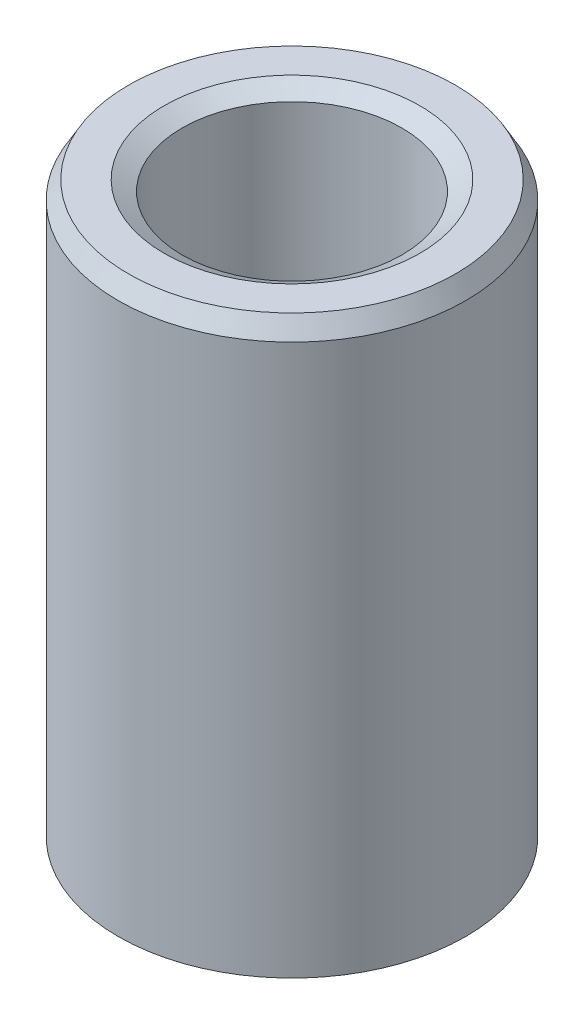
ISO-10303-21;
HEADER;
FILE_DESCRIPTION(('STEP AP214'),'2;1');
FILE_NAME('part.step','',(''),(''),'','','');
FILE_SCHEMA(('AUTOMOTIVE_DESIGN { 1 0 10303 214 1 1 1 1 }'));
ENDSEC;
DATA;
#1=APPLICATION_CONTEXT('core data for automotive mechanical design processes');
#2=APPLICATION_PROTOCOL_DEFINITION('international standard','automotive_design',2000,#1);
#3=PRODUCT_CONTEXT('',#1,'mechanical');
#4=PRODUCT('Part','Part','',(#3));
#5=PRODUCT_RELATED_PRODUCT_CATEGORY('part','',(#4));
#6=PRODUCT_DEFINITION_FORMATION('','',#4);
#7=PRODUCT_DEFINITION_CONTEXT('part definition',#1,'design');
#8=PRODUCT_DEFINITION('design','',#6,#7);
#9=PRODUCT_DEFINITION_SHAPE('','',#8);
#10=(LENGTH_UNIT() NAMED_UNIT(*) SI_UNIT(.MILLI.,.METRE.));
#11=(NAMED_UNIT(*) PLANE_ANGLE_UNIT() SI_UNIT($,.RADIAN.));
#12=(NAMED_UNIT(*) SI_UNIT($,.STERADIAN.) SOLID_ANGLE_UNIT());
#13=UNCERTAINTY_MEASURE_WITH_UNIT(LENGTH_MEASURE(1.E-05),#10,'distance_accuracy_value','');
#14=(GEOMETRIC_REPRESENTATION_CONTEXT(3) GLOBAL_UNCERTAINTY_ASSIGNED_CONTEXT((#13)) GLOBAL_UNIT_ASSIGNED_CONTEXT((#10,
#11,#12)) REPRESENTATION_CONTEXT('',''));
#15=CARTESIAN_POINT('',(0.,0.,0.));
#16=DIRECTION('',(0.,0.,1.));
#17=DIRECTION('',(1.,0.,0.));
#18=AXIS2_PLACEMENT_3D('',#15,#16,#17);
#19=CARTESIAN_POINT('',(0.,124.881797904271,0.));
#20=DIRECTION('',(0.,-1.,0.));
#21=DIRECTION('',(0.,0.,-1.));
#22=AXIS2_PLACEMENT_3D('',#19,#20,#21);
#23=CYLINDRICAL_SURFACE('',#22,37.5);
#24=CARTESIAN_POINT('',(0.,2.23251376503614,0.));
#25=DIRECTION('',(0.,1.,0.));
#26=DIRECTION('',(0.,0.,1.));
#27=AXIS2_PLACEMENT_3D('',#24,#25,#26);
#28=CIRCLE('',#27,37.5);
#29=CARTESIAN_POINT('',(0.,2.23251376503614,37.5));
#30=VERTEX_POINT('',#29);
#31=EDGE_CURVE('E10',#30,#30,#28,.T.);
#32=ORIENTED_EDGE('',*,*,#31,.T.);
#33=EDGE_LOOP('',(#32));
#34=FACE_BOUND('',#33,.T.);
#35=CARTESIAN_POINT('',(0.,121.014970634632,0.));
#36=DIRECTION('',(0.,1.,0.));
#37=DIRECTION('',(0.,0.,1.));
#38=AXIS2_PLACEMENT_3D('',#35,#36,#37);
#39=CIRCLE('',#38,37.5);
#40=CARTESIAN_POINT('',(0.,121.014970634632,-37.5));
#41=VERTEX_POINT('',#40);
#42=EDGE_CURVE('E50',#41,#41,#39,.F.);
#43=ORIENTED_EDGE('',*,*,#42,.T.);
#44=EDGE_LOOP('',(#43));
#45=FACE_BOUND('',#44,.T.);
#46=ADVANCED_FACE('F39',(#34,#45),#23,.T.);
#47=CARTESIAN_POINT('',(0.,124.881797904271,0.));
#48=DIRECTION('',(0.,1.,0.));
#49=DIRECTION('',(0.,0.,1.));
#50=AXIS2_PLACEMENT_3D('',#47,#48,#49);
#51=PLANE('',#50);
#52=CARTESIAN_POINT('',(0.,124.881797904271,0.));
#53=DIRECTION('',(0.,1.,0.));
#54=DIRECTION('',(0.,0.,1.));
#55=AXIS2_PLACEMENT_3D('',#52,#53,#54);
#56=CIRCLE('',#55,27.5829610137691);
#57=CARTESIAN_POINT('',(0.,124.881797904271,27.5829610137691));
#58=VERTEX_POINT('',#57);
#59=EDGE_CURVE('E58',#58,#58,#56,.F.);
#60=ORIENTED_EDGE('',*,*,#59,.T.);
#61=EDGE_LOOP('',(#60));
#62=FACE_BOUND('',#61,.T.);
#63=CARTESIAN_POINT('',(0.,124.881797904271,0.));
#64=DIRECTION('',(0.,1.,0.));
#65=DIRECTION('',(0.,0.,1.));
#66=AXIS2_PLACEMENT_3D('',#63,#64,#65);
#67=CIRCLE('',#66,35.2674862349639);
#68=CARTESIAN_POINT('',(0.,124.881797904271,-35.2674862349639));
#69=VERTEX_POINT('',#68);
#70=EDGE_CURVE('E61',#69,#69,#67,.T.);
#71=ORIENTED_EDGE('',*,*,#70,.T.);
#72=EDGE_LOOP('',(#71));
#73=FACE_BOUND('',#72,.T.);
#74=ADVANCED_FACE('F88',(#62,#73),#51,.T.);
#75=CARTESIAN_POINT('',(0.,0.,0.));
#76=DIRECTION('',(0.,1.,0.));
#77=DIRECTION('',(0.,0.,1.));
#78=AXIS2_PLACEMENT_3D('',#75,#76,#77);
#79=PLANE('',#78);
#80=CARTESIAN_POINT('',(0.,0.,0.));
#81=DIRECTION('',(0.,1.,0.));
#82=DIRECTION('',(0.,0.,1.));
#83=AXIS2_PLACEMENT_3D('',#80,#81,#82);
#84=CIRCLE('',#83,25.9486475091657);
#85=CARTESIAN_POINT('',(0.,0.,25.9486475091657));
#86=VERTEX_POINT('',#85);
#87=EDGE_CURVE('E51',#86,#86,#84,.T.);
#88=ORIENTED_EDGE('',*,*,#87,.T.);
#89=EDGE_LOOP('',(#88));
#90=FACE_BOUND('',#89,.T.);
#91=CARTESIAN_POINT('',(0.,0.,0.));
#92=DIRECTION('',(0.,1.,0.));
#93=DIRECTION('',(0.,0.,1.));
#94=AXIS2_PLACEMENT_3D('',#91,#92,#93);
#95=CIRCLE('',#94,33.6331727303605);
#96=CARTESIAN_POINT('',(0.,0.,33.6331727303605));
#97=VERTEX_POINT('',#96);
#98=EDGE_CURVE('E54',#97,#97,#95,.F.);
#99=ORIENTED_EDGE('',*,*,#98,.T.);
#100=EDGE_LOOP('',(#99));
#101=FACE_BOUND('',#100,.T.);
#102=ADVANCED_FACE('F83',(#90,#101),#79,.F.);
#103=CARTESIAN_POINT('',(0.,124.881797904271,0.));
#104=DIRECTION('',(0.,-1.,0.));
#105=DIRECTION('',(0.,0.,-1.));
#106=AXIS2_PLACEMENT_3D('',#103,#104,#105);
#107=CYLINDRICAL_SURFACE('',#106,23.7161337441296);
#108=CARTESIAN_POINT('',(0.,122.649284139235,0.));
#109=DIRECTION('',(0.,1.,0.));
#110=DIRECTION('',(0.,0.,1.));
#111=AXIS2_PLACEMENT_3D('',#108,#109,#110);
#112=CIRCLE('',#111,23.7161337441296);
#113=CARTESIAN_POINT('',(0.,122.649284139235,23.7161337441296));
#114=VERTEX_POINT('',#113);
#115=EDGE_CURVE('E67',#114,#114,#112,.T.);
#116=ORIENTED_EDGE('',*,*,#115,.T.);
#117=EDGE_LOOP('',(#116));
#118=FACE_BOUND('',#117,.T.);
#119=CARTESIAN_POINT('',(0.,3.86682726963951,0.));
#120=DIRECTION('',(0.,1.,0.));
#121=DIRECTION('',(0.,0.,1.));
#122=AXIS2_PLACEMENT_3D('',#119,#120,#121);
#123=CIRCLE('',#122,23.7161337441296);
#124=CARTESIAN_POINT('',(0.,3.86682726963951,23.7161337441296));
#125=VERTEX_POINT('',#124);
#126=EDGE_CURVE('E69',#125,#125,#123,.F.);
#127=ORIENTED_EDGE('',*,*,#126,.T.);
#128=EDGE_LOOP('',(#127));
#129=FACE_BOUND('',#128,.T.);
#130=ADVANCED_FACE('F71',(#118,#129),#107,.F.);
#131=CARTESIAN_POINT('',(0.,122.649284139235,0.));
#132=DIRECTION('',(0.,1.,0.));
#133=DIRECTION('',(0.,0.,1.));
#134=AXIS2_PLACEMENT_3D('',#131,#132,#133);
#135=CONICAL_SURFACE('',#134,23.7161337441296,1.0471975511966);
#136=ORIENTED_EDGE('',*,*,#59,.F.);
#137=EDGE_LOOP('',(#136));
#138=FACE_BOUND('',#137,.T.);
#139=ORIENTED_EDGE('',*,*,#115,.F.);
#140=EDGE_LOOP('',(#139));
#141=FACE_BOUND('',#140,.T.);
#142=ADVANCED_FACE('F77',(#138,#141),#135,.F.);
#143=CARTESIAN_POINT('',(0.,0.,0.));
#144=DIRECTION('',(0.,-1.,0.));
#145=DIRECTION('',(0.,0.,-1.));
#146=AXIS2_PLACEMENT_3D('',#143,#144,#145);
#147=CONICAL_SURFACE('',#146,25.9486475091657,0.523598775598293);
#148=ORIENTED_EDGE('',*,*,#126,.F.);
#149=EDGE_LOOP('',(#148));
#150=FACE_BOUND('',#149,.T.);
#151=ORIENTED_EDGE('',*,*,#87,.F.);
#152=EDGE_LOOP('',(#151));
#153=FACE_BOUND('',#152,.T.);
#154=ADVANCED_FACE('F73',(#150,#153),#147,.F.);
#155=CARTESIAN_POINT('',(0.,2.23251376503614,0.));
#156=DIRECTION('',(0.,1.,0.));
#157=DIRECTION('',(0.,0.,1.));
#158=AXIS2_PLACEMENT_3D('',#155,#156,#157);
#159=CONICAL_SURFACE('',#158,37.5,1.0471975511966);
#160=ORIENTED_EDGE('',*,*,#98,.F.);
#161=EDGE_LOOP('',(#160));
#162=FACE_BOUND('',#161,.T.);
#163=ORIENTED_EDGE('',*,*,#31,.F.);
#164=EDGE_LOOP('',(#163));
#165=FACE_BOUND('',#164,.T.);
#166=ADVANCED_FACE('F76',(#162,#165),#159,.T.);
#167=CARTESIAN_POINT('',(0.,124.881797904271,0.));
#168=DIRECTION('',(0.,-1.,0.));
#169=DIRECTION('',(0.,0.,-1.));
#170=AXIS2_PLACEMENT_3D('',#167,#168,#169);
#171=CONICAL_SURFACE('',#170,35.2674862349639,0.523598775598296);
#172=CARTESIAN_POINT('',(0.,121.014970634632,-37.5));
#173=CARTESIAN_POINT('',(0.,121.055250085357,-37.4767446482809));
#174=CARTESIAN_POINT('',(0.,121.095529536082,-37.4534892965618));
#175=CARTESIAN_POINT('',(0.,121.176088437533,-37.4069785931235));
#176=CARTESIAN_POINT('',(0.,121.216367888259,-37.3837232414044));
#177=CARTESIAN_POINT('',(0.,121.29692678971,-37.3372125379661));
#178=CARTESIAN_POINT('',(0.,121.337206240435,-37.313957186247));
#179=CARTESIAN_POINT('',(0.,121.417765141886,-37.2674464828087));
#180=CARTESIAN_POINT('',(0.,121.458044592611,-37.2441911310896));
#181=CARTESIAN_POINT('',(0.,121.538603494062,-37.1976804276514));
#182=CARTESIAN_POINT('',(0.,121.578882944787,-37.1744250759322));
#183=CARTESIAN_POINT('',(0.,121.659441846238,-37.127914372494));
#184=CARTESIAN_POINT('',(0.,121.699721296964,-37.1046590207749));
#185=CARTESIAN_POINT('',(0.,121.780280198414,-37.0581483173366));
#186=CARTESIAN_POINT('',(0.,121.82055964914,-37.0348929656175));
#187=CARTESIAN_POINT('',(0.,121.901118550591,-36.9883822621792));
#188=CARTESIAN_POINT('',(0.,121.941398001316,-36.9651269104601));
#189=CARTESIAN_POINT('',(0.,122.021956902767,-36.9186162070219));
#190=CARTESIAN_POINT('',(0.,122.062236353492,-36.8953608553027));
#191=CARTESIAN_POINT('',(0.,122.142795254943,-36.8488501518645));
#192=CARTESIAN_POINT('',(0.,122.183074705669,-36.8255948001453));
#193=CARTESIAN_POINT('',(0.,122.263633607119,-36.7790840967071));
#194=CARTESIAN_POINT('',(0.,122.303913057845,-36.755828744988));
#195=CARTESIAN_POINT('',(0.,122.384471959296,-36.7093180415497));
#196=CARTESIAN_POINT('',(0.,122.424751410021,-36.6860626898306));
#197=CARTESIAN_POINT('',(0.,122.505310311472,-36.6395519863923));
#198=CARTESIAN_POINT('',(0.,122.545589762197,-36.6162966346732));
#199=CARTESIAN_POINT('',(0.,122.626148663648,-36.569785931235));
#200=CARTESIAN_POINT('',(0.,122.666428114374,-36.5465305795158));
#201=CARTESIAN_POINT('',(0.,122.746987015824,-36.5000198760776));
#202=CARTESIAN_POINT('',(0.,122.78726646655,-36.4767645243585));
#203=CARTESIAN_POINT('',(0.,122.867825368001,-36.4302538209202));
#204=CARTESIAN_POINT('',(0.,122.908104818726,-36.4069984692011));
#205=CARTESIAN_POINT('',(0.,122.988663720177,-36.3604877657628));
#206=CARTESIAN_POINT('',(0.,123.028943170902,-36.3372324140437));
#207=CARTESIAN_POINT('',(0.,123.109502072353,-36.2907217106054));
#208=CARTESIAN_POINT('',(0.,123.149781523078,-36.2674663588863));
#209=CARTESIAN_POINT('',(0.,123.230340424529,-36.2209556554481));
#210=CARTESIAN_POINT('',(0.,123.270619875255,-36.1977003037289));
#211=CARTESIAN_POINT('',(0.,123.351178776705,-36.1511896002907));
#212=CARTESIAN_POINT('',(0.,123.391458227431,-36.1279342485716));
#213=CARTESIAN_POINT('',(0.,123.472017128882,-36.0814235451333));
#214=CARTESIAN_POINT('',(0.,123.512296579607,-36.0581681934142));
#215=CARTESIAN_POINT('',(0.,123.592855481058,-36.0116574899759));
#216=CARTESIAN_POINT('',(0.,123.633134931783,-35.9884021382568));
#217=CARTESIAN_POINT('',(0.,123.713693833234,-35.9418914348185));
#218=CARTESIAN_POINT('',(0.,123.75397328396,-35.9186360830994));
#219=CARTESIAN_POINT('',(0.,123.83453218541,-35.8721253796612));
#220=CARTESIAN_POINT('',(0.,123.874811636136,-35.848870027942));
#221=CARTESIAN_POINT('',(0.,123.955370537587,-35.8023593245038));
#222=CARTESIAN_POINT('',(0.,123.995649988312,-35.7791039727847));
#223=CARTESIAN_POINT('',(0.,124.076208889763,-35.7325932693464));
#224=CARTESIAN_POINT('',(0.,124.116488340488,-35.7093379176273));
#225=CARTESIAN_POINT('',(0.,124.197047241939,-35.662827214189));
#226=CARTESIAN_POINT('',(0.,124.237326692665,-35.6395718624699));
#227=CARTESIAN_POINT('',(0.,124.317885594115,-35.5930611590317));
#228=CARTESIAN_POINT('',(0.,124.358165044841,-35.5698058073125));
#229=CARTESIAN_POINT('',(0.,124.438723946292,-35.5232951038743));
#230=CARTESIAN_POINT('',(0.,124.479003397017,-35.5000397521551));
#231=CARTESIAN_POINT('',(0.,124.559562298468,-35.4535290487169));
#232=CARTESIAN_POINT('',(0.,124.599841749193,-35.4302736969978));
#233=CARTESIAN_POINT('',(0.,124.680400650644,-35.3837629935595));
#234=CARTESIAN_POINT('',(0.,124.720680101369,-35.3605076418404));
#235=CARTESIAN_POINT('',(0.,124.80123900282,-35.3139969384021));
#236=CARTESIAN_POINT('',(0.,124.841518453546,-35.290741586683));
#237=CARTESIAN_POINT('',(0.,124.881797904271,-35.2674862349639));
#238=B_SPLINE_CURVE_WITH_KNOTS('',3,(#172,#173,#174,#175,#176,#177,#178,#179,#180,#181,#182,
#183,#184,#185,#186,#187,#188,#189,#190,#191,#192,#193,#194,#195,#196,#197,#198,#199,#200,#201,
#202,#203,#204,#205,#206,#207,#208,#209,#210,#211,#212,#213,#214,#215,#216,#217,#218,#219,#220,
#221,#222,#223,#224,#225,#226,#227,#228,#229,#230,#231,#232,#233,#234,#235,#236,#237),
.UNSPECIFIED.,.F.,.F.,(4,2,2,2,2,2,2,2,2,2,2,2,2,2,2,2,2,2,2,2,2,2,2,2,2,2,2,2,2,2,2,2,4),(0.,
0.139532110314771,0.279064220629526,0.418596330944281,0.558128441259036,0.697660551573804,
0.837192661888559,0.976724772203317,1.11625688251807,1.25578899283283,1.39532110314759,
1.53485321346235,1.67438532377711,1.81391743409186,1.95344954440663,2.09298165472139,
2.23251376503614,2.3720458753509,2.51157798566565,2.65111009598042,2.79064220629518,
2.93017431660993,3.06970642692469,3.20923853723946,3.34877064755421,3.48830275786897,
3.62783486818372,3.76736697849848,3.90689908881325,4.046431199128,4.18596330944276,
4.32549541975751,4.46502753007228),.UNSPECIFIED.);
#239=EDGE_CURVE('BSEAM45',#41,#69,#238,.T.);
#240=ORIENTED_EDGE('',*,*,#42,.F.);
#241=ORIENTED_EDGE('',*,*,#70,.F.);
#242=ORIENTED_EDGE('',*,*,#239,.T.);
#243=ORIENTED_EDGE('',*,*,#239,.F.);
#244=EDGE_LOOP('',(#240,#242,#241,#243));
#245=FACE_BOUND('',#244,.T.);
#246=ADVANCED_FACE('F45',(#245),#171,.T.);
#247=CLOSED_SHELL('',(#46,#74,#102,#130,#142,#154,#166,#246));
#248=MANIFOLD_SOLID_BREP('B2',#247);
#249=ADVANCED_BREP_SHAPE_REPRESENTATION('',(#18,#248),#14);
#250=SHAPE_DEFINITION_REPRESENTATION(#9,#249);
ENDSEC;
END-ISO-10303-21;
